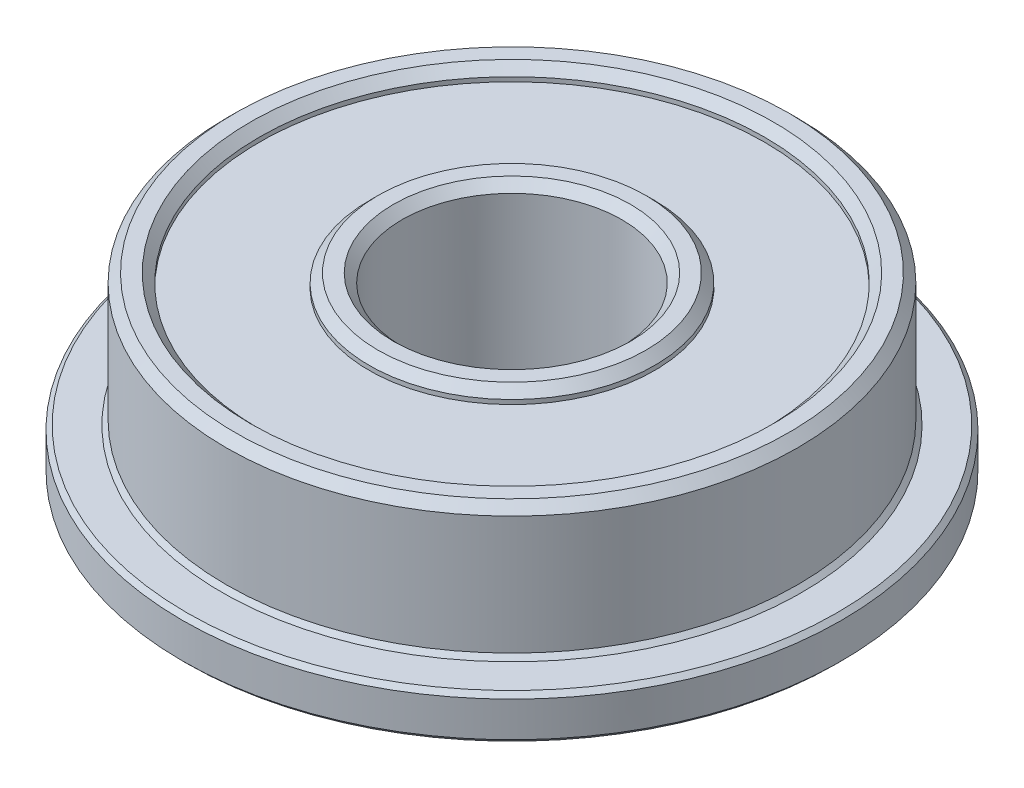
ISO-10303-21;
HEADER;
FILE_DESCRIPTION(('STEP AP214'),'2;1');
FILE_NAME('part.step','',(''),(''),'','','');
FILE_SCHEMA(('AUTOMOTIVE_DESIGN { 1 0 10303 214 1 1 1 1 }'));
ENDSEC;
DATA;
#1=APPLICATION_CONTEXT('core data for automotive mechanical design processes');
#2=APPLICATION_PROTOCOL_DEFINITION('international standard','automotive_design',2000,#1);
#3=PRODUCT_CONTEXT('',#1,'mechanical');
#4=PRODUCT('Part','Part','',(#3));
#5=PRODUCT_RELATED_PRODUCT_CATEGORY('part','',(#4));
#6=PRODUCT_DEFINITION_FORMATION('','',#4);
#7=PRODUCT_DEFINITION_CONTEXT('part definition',#1,'design');
#8=PRODUCT_DEFINITION('design','',#6,#7);
#9=PRODUCT_DEFINITION_SHAPE('','',#8);
#10=(LENGTH_UNIT() NAMED_UNIT(*) SI_UNIT(.MILLI.,.METRE.));
#11=(NAMED_UNIT(*) PLANE_ANGLE_UNIT() SI_UNIT($,.RADIAN.));
#12=(NAMED_UNIT(*) SI_UNIT($,.STERADIAN.) SOLID_ANGLE_UNIT());
#13=UNCERTAINTY_MEASURE_WITH_UNIT(LENGTH_MEASURE(1.E-05),#10,'distance_accuracy_value','');
#14=(GEOMETRIC_REPRESENTATION_CONTEXT(3) GLOBAL_UNCERTAINTY_ASSIGNED_CONTEXT((#13)) GLOBAL_UNIT_ASSIGNED_CONTEXT((#10,
#11,#12)) REPRESENTATION_CONTEXT('',''));
#15=CARTESIAN_POINT('',(0.,0.,0.));
#16=DIRECTION('',(0.,0.,1.));
#17=DIRECTION('',(1.,0.,0.));
#18=AXIS2_PLACEMENT_3D('',#15,#16,#17);
#19=CARTESIAN_POINT('',(0.,0.,0.));
#20=DIRECTION('',(0.,-1.,0.));
#21=DIRECTION('',(0.,0.,-1.));
#22=AXIS2_PLACEMENT_3D('',#19,#20,#21);
#23=PLANE('',#22);
#24=CARTESIAN_POINT('',(0.,0.,0.));
#25=DIRECTION('',(0.,-1.,0.));
#26=DIRECTION('',(0.,0.,-1.));
#27=AXIS2_PLACEMENT_3D('',#24,#25,#26);
#28=CIRCLE('',#27,2.69999999994752);
#29=CARTESIAN_POINT('',(0.,0.,-2.69999999994752));
#30=VERTEX_POINT('',#29);
#31=EDGE_CURVE('E18',#30,#30,#28,.F.);
#32=ORIENTED_EDGE('',*,*,#31,.T.);
#33=EDGE_LOOP('',(#32));
#34=FACE_BOUND('',#33,.T.);
#35=CARTESIAN_POINT('',(0.,-5.68433917557537E-11,0.));
#36=DIRECTION('',(0.,1.,0.));
#37=DIRECTION('',(0.,0.,1.));
#38=AXIS2_PLACEMENT_3D('',#35,#36,#37);
#39=CIRCLE('',#38,3.0500000000302);
#40=CARTESIAN_POINT('',(0.,-5.68440531190789E-11,3.0500000000302));
#41=VERTEX_POINT('',#40);
#42=EDGE_CURVE('E58',#41,#41,#39,.T.);
#43=ORIENTED_EDGE('',*,*,#42,.F.);
#44=EDGE_LOOP('',(#43));
#45=FACE_BOUND('',#44,.T.);
#46=ADVANCED_FACE('F15',(#34,#45),#23,.T.);
#47=CARTESIAN_POINT('',(0.,0.,0.));
#48=DIRECTION('',(0.,-1.,0.));
#49=DIRECTION('',(0.,0.,-1.));
#50=AXIS2_PLACEMENT_3D('',#47,#48,#49);
#51=CONICAL_SURFACE('',#50,2.69999999994752,0.785398163397448);
#52=CARTESIAN_POINT('',(0.,0.2,0.));
#53=DIRECTION('',(0.,-1.,0.));
#54=DIRECTION('',(0.,0.,-1.));
#55=AXIS2_PLACEMENT_3D('',#52,#53,#54);
#56=CIRCLE('',#55,2.5);
#57=CARTESIAN_POINT('',(0.,0.200000000000001,-2.5));
#58=VERTEX_POINT('',#57);
#59=EDGE_CURVE('E55',#58,#58,#56,.F.);
#60=ORIENTED_EDGE('',*,*,#59,.T.);
#61=EDGE_LOOP('',(#60));
#62=FACE_BOUND('',#61,.T.);
#63=ORIENTED_EDGE('',*,*,#31,.F.);
#64=EDGE_LOOP('',(#63));
#65=FACE_BOUND('',#64,.T.);
#66=ADVANCED_FACE('F99',(#62,#65),#51,.F.);
#67=CARTESIAN_POINT('',(0.,0.199999999836109,0.));
#68=DIRECTION('',(0.,1.,0.));
#69=DIRECTION('',(0.,0.,1.));
#70=AXIS2_PLACEMENT_3D('',#67,#68,#69);
#71=CONICAL_SURFACE('',#70,3.24999999992315,0.785398163397448);
#72=CARTESIAN_POINT('',(0.,0.2,0.));
#73=DIRECTION('',(0.,1.,0.));
#74=DIRECTION('',(0.,0.,1.));
#75=AXIS2_PLACEMENT_3D('',#72,#73,#74);
#76=CIRCLE('',#75,3.25);
#77=CARTESIAN_POINT('',(0.,0.199999999999999,3.25));
#78=VERTEX_POINT('',#77);
#79=EDGE_CURVE('E51',#78,#78,#76,.T.);
#80=ORIENTED_EDGE('',*,*,#79,.F.);
#81=EDGE_LOOP('',(#80));
#82=FACE_BOUND('',#81,.T.);
#83=ORIENTED_EDGE('',*,*,#42,.T.);
#84=EDGE_LOOP('',(#83));
#85=FACE_BOUND('',#84,.T.);
#86=ADVANCED_FACE('F101',(#82,#85),#71,.T.);
#87=CARTESIAN_POINT('',(0.,4.,0.));
#88=DIRECTION('',(0.,-1.,0.));
#89=DIRECTION('',(0.,0.,-1.));
#90=AXIS2_PLACEMENT_3D('',#87,#88,#89);
#91=CYLINDRICAL_SURFACE('',#90,2.5);
#92=ORIENTED_EDGE('',*,*,#59,.F.);
#93=EDGE_LOOP('',(#92));
#94=FACE_BOUND('',#93,.T.);
#95=CARTESIAN_POINT('',(0.,3.79999999995562,0.));
#96=DIRECTION('',(0.,1.,0.));
#97=DIRECTION('',(-1.,0.,0.));
#98=AXIS2_PLACEMENT_3D('',#95,#96,#97);
#99=CIRCLE('',#98,2.49999999994088);
#100=CARTESIAN_POINT('',(-2.49999999994088,3.79999999995562,0.));
#101=VERTEX_POINT('',#100);
#102=EDGE_CURVE('E54',#101,#101,#99,.T.);
#103=ORIENTED_EDGE('',*,*,#102,.T.);
#104=EDGE_LOOP('',(#103));
#105=FACE_BOUND('',#104,.T.);
#106=ADVANCED_FACE('F108',(#94,#105),#91,.F.);
#107=CARTESIAN_POINT('',(0.,0.,0.));
#108=DIRECTION('',(0.,1.,0.));
#109=DIRECTION('',(0.,0.,1.));
#110=AXIS2_PLACEMENT_3D('',#107,#108,#109);
#111=CYLINDRICAL_SURFACE('',#110,3.25);
#112=CARTESIAN_POINT('',(0.,0.3,0.));
#113=DIRECTION('',(0.,1.,0.));
#114=DIRECTION('',(0.,0.,1.));
#115=AXIS2_PLACEMENT_3D('',#112,#113,#114);
#116=CIRCLE('',#115,3.25);
#117=CARTESIAN_POINT('',(0.,0.299999999999999,3.25));
#118=VERTEX_POINT('',#117);
#119=EDGE_CURVE('E61',#118,#118,#116,.T.);
#120=ORIENTED_EDGE('',*,*,#119,.F.);
#121=EDGE_LOOP('',(#120));
#122=FACE_BOUND('',#121,.T.);
#123=ORIENTED_EDGE('',*,*,#79,.T.);
#124=EDGE_LOOP('',(#123));
#125=FACE_BOUND('',#124,.T.);
#126=ADVANCED_FACE('F189',(#122,#125),#111,.T.);
#127=CARTESIAN_POINT('',(0.,4.0000000000191,0.));
#128=DIRECTION('',(0.,1.,0.));
#129=DIRECTION('',(0.,0.,1.));
#130=AXIS2_PLACEMENT_3D('',#127,#128,#129);
#131=CONICAL_SURFACE('',#130,2.70000000000437,0.785398163397448);
#132=ORIENTED_EDGE('',*,*,#102,.F.);
#133=EDGE_LOOP('',(#132));
#134=FACE_BOUND('',#133,.T.);
#135=CARTESIAN_POINT('',(0.,4.0000000000191,0.));
#136=DIRECTION('',(0.,1.,0.));
#137=DIRECTION('',(0.,0.,1.));
#138=AXIS2_PLACEMENT_3D('',#135,#136,#137);
#139=CIRCLE('',#138,2.70000000000437);
#140=CARTESIAN_POINT('',(0.,4.0000000000191,2.70000000000437));
#141=VERTEX_POINT('',#140);
#142=EDGE_CURVE('E87',#141,#141,#139,.F.);
#143=ORIENTED_EDGE('',*,*,#142,.F.);
#144=EDGE_LOOP('',(#143));
#145=FACE_BOUND('',#144,.T.);
#146=ADVANCED_FACE('F185',(#134,#145),#131,.F.);
#147=CARTESIAN_POINT('',(0.,0.3,0.));
#148=DIRECTION('',(0.,-1.,0.));
#149=DIRECTION('',(0.,0.,-1.));
#150=AXIS2_PLACEMENT_3D('',#147,#148,#149);
#151=PLANE('',#150);
#152=ORIENTED_EDGE('',*,*,#119,.T.);
#153=EDGE_LOOP('',(#152));
#154=FACE_BOUND('',#153,.T.);
#155=CARTESIAN_POINT('',(0.,0.3,0.));
#156=DIRECTION('',(0.,1.,0.));
#157=DIRECTION('',(0.,0.,1.));
#158=AXIS2_PLACEMENT_3D('',#155,#156,#157);
#159=CIRCLE('',#158,5.75);
#160=CARTESIAN_POINT('',(0.,0.299999999999999,5.75));
#161=VERTEX_POINT('',#160);
#162=EDGE_CURVE('E84',#161,#161,#159,.F.);
#163=ORIENTED_EDGE('',*,*,#162,.T.);
#164=EDGE_LOOP('',(#163));
#165=FACE_BOUND('',#164,.T.);
#166=ADVANCED_FACE('F181',(#154,#165),#151,.T.);
#167=CARTESIAN_POINT('',(0.,4.,0.));
#168=DIRECTION('',(0.,1.,0.));
#169=DIRECTION('',(0.,0.,1.));
#170=AXIS2_PLACEMENT_3D('',#167,#168,#169);
#171=PLANE('',#170);
#172=ORIENTED_EDGE('',*,*,#142,.T.);
#173=EDGE_LOOP('',(#172));
#174=FACE_BOUND('',#173,.T.);
#175=CARTESIAN_POINT('',(0.,3.99999999996226,0.));
#176=DIRECTION('',(0.,-1.,0.));
#177=DIRECTION('',(0.,0.,-1.));
#178=AXIS2_PLACEMENT_3D('',#175,#176,#177);
#179=CIRCLE('',#178,3.0500000000302);
#180=CARTESIAN_POINT('',(0.,3.99999999996226,-3.05000000003019));
#181=VERTEX_POINT('',#180);
#182=EDGE_CURVE('E50',#181,#181,#179,.T.);
#183=ORIENTED_EDGE('',*,*,#182,.F.);
#184=EDGE_LOOP('',(#183));
#185=FACE_BOUND('',#184,.T.);
#186=ADVANCED_FACE('F177',(#174,#185),#171,.T.);
#187=CARTESIAN_POINT('',(0.,0.,0.));
#188=DIRECTION('',(0.,1.,0.));
#189=DIRECTION('',(0.,0.,1.));
#190=AXIS2_PLACEMENT_3D('',#187,#188,#189);
#191=CYLINDRICAL_SURFACE('',#190,5.75);
#192=ORIENTED_EDGE('',*,*,#162,.F.);
#193=EDGE_LOOP('',(#192));
#194=FACE_BOUND('',#193,.T.);
#195=CARTESIAN_POINT('',(0.,0.200000000006639,0.));
#196=DIRECTION('',(0.,-1.,0.));
#197=DIRECTION('',(1.,0.,0.));
#198=AXIS2_PLACEMENT_3D('',#195,#196,#197);
#199=CIRCLE('',#198,5.75000000003456);
#200=CARTESIAN_POINT('',(5.75000000003456,0.200000000006639,0.));
#201=VERTEX_POINT('',#200);
#202=EDGE_CURVE('E47',#201,#201,#199,.T.);
#203=ORIENTED_EDGE('',*,*,#202,.T.);
#204=EDGE_LOOP('',(#203));
#205=FACE_BOUND('',#204,.T.);
#206=ADVANCED_FACE('F173',(#194,#205),#191,.F.);
#207=CARTESIAN_POINT('',(0.,3.80000000001246,0.));
#208=DIRECTION('',(0.,-1.,0.));
#209=DIRECTION('',(0.,0.,-1.));
#210=AXIS2_PLACEMENT_3D('',#207,#208,#209);
#211=CONICAL_SURFACE('',#210,3.24999999997999,0.785398163397448);
#212=CARTESIAN_POINT('',(0.,3.8,0.));
#213=DIRECTION('',(0.,-1.,0.));
#214=DIRECTION('',(0.,0.,-1.));
#215=AXIS2_PLACEMENT_3D('',#212,#213,#214);
#216=CIRCLE('',#215,3.25);
#217=CARTESIAN_POINT('',(0.,3.8,-3.25));
#218=VERTEX_POINT('',#217);
#219=EDGE_CURVE('E43',#218,#218,#216,.T.);
#220=ORIENTED_EDGE('',*,*,#219,.F.);
#221=EDGE_LOOP('',(#220));
#222=FACE_BOUND('',#221,.T.);
#223=ORIENTED_EDGE('',*,*,#182,.T.);
#224=EDGE_LOOP('',(#223));
#225=FACE_BOUND('',#224,.T.);
#226=ADVANCED_FACE('F169',(#222,#225),#211,.T.);
#227=CARTESIAN_POINT('',(0.,5.6843418860808E-11,0.));
#228=DIRECTION('',(0.,-1.,0.));
#229=DIRECTION('',(0.,0.,-1.));
#230=AXIS2_PLACEMENT_3D('',#227,#228,#229);
#231=CONICAL_SURFACE('',#230,5.94999999998436,0.785398163397448);
#232=ORIENTED_EDGE('',*,*,#202,.F.);
#233=EDGE_LOOP('',(#232));
#234=FACE_BOUND('',#233,.T.);
#235=CARTESIAN_POINT('',(0.,0.,0.));
#236=DIRECTION('',(0.,-1.,0.));
#237=DIRECTION('',(0.,0.,-1.));
#238=AXIS2_PLACEMENT_3D('',#235,#236,#237);
#239=CIRCLE('',#238,5.9500000000412);
#240=CARTESIAN_POINT('',(0.,0.,-5.9500000000412));
#241=VERTEX_POINT('',#240);
#242=EDGE_CURVE('E46',#241,#241,#239,.F.);
#243=ORIENTED_EDGE('',*,*,#242,.F.);
#244=EDGE_LOOP('',(#243));
#245=FACE_BOUND('',#244,.T.);
#246=ADVANCED_FACE('F165',(#234,#245),#231,.F.);
#247=CARTESIAN_POINT('',(0.,4.,0.));
#248=DIRECTION('',(0.,-1.,0.));
#249=DIRECTION('',(0.,0.,-1.));
#250=AXIS2_PLACEMENT_3D('',#247,#248,#249);
#251=CYLINDRICAL_SURFACE('',#250,3.25);
#252=CARTESIAN_POINT('',(0.,3.7,0.));
#253=DIRECTION('',(0.,-1.,0.));
#254=DIRECTION('',(0.,0.,-1.));
#255=AXIS2_PLACEMENT_3D('',#252,#253,#254);
#256=CIRCLE('',#255,3.25);
#257=CARTESIAN_POINT('',(0.,3.7,-3.25));
#258=VERTEX_POINT('',#257);
#259=EDGE_CURVE('E77',#258,#258,#256,.T.);
#260=ORIENTED_EDGE('',*,*,#259,.F.);
#261=EDGE_LOOP('',(#260));
#262=FACE_BOUND('',#261,.T.);
#263=ORIENTED_EDGE('',*,*,#219,.T.);
#264=EDGE_LOOP('',(#263));
#265=FACE_BOUND('',#264,.T.);
#266=ADVANCED_FACE('F161',(#262,#265),#251,.T.);
#267=CARTESIAN_POINT('',(0.,0.,0.));
#268=DIRECTION('',(0.,-1.,0.));
#269=DIRECTION('',(0.,0.,-1.));
#270=AXIS2_PLACEMENT_3D('',#267,#268,#269);
#271=PLANE('',#270);
#272=ORIENTED_EDGE('',*,*,#242,.T.);
#273=EDGE_LOOP('',(#272));
#274=FACE_BOUND('',#273,.T.);
#275=CARTESIAN_POINT('',(0.,0.,0.));
#276=DIRECTION('',(0.,1.,0.));
#277=DIRECTION('',(0.,0.,1.));
#278=AXIS2_PLACEMENT_3D('',#275,#276,#277);
#279=CIRCLE('',#278,7.4);
#280=CARTESIAN_POINT('',(0.,0.,7.4));
#281=VERTEX_POINT('',#280);
#282=EDGE_CURVE('E74',#281,#281,#279,.T.);
#283=ORIENTED_EDGE('',*,*,#282,.F.);
#284=EDGE_LOOP('',(#283));
#285=FACE_BOUND('',#284,.T.);
#286=ADVANCED_FACE('F157',(#274,#285),#271,.T.);
#287=CARTESIAN_POINT('',(0.,3.7,0.));
#288=DIRECTION('',(0.,1.,0.));
#289=DIRECTION('',(0.,0.,1.));
#290=AXIS2_PLACEMENT_3D('',#287,#288,#289);
#291=PLANE('',#290);
#292=ORIENTED_EDGE('',*,*,#259,.T.);
#293=EDGE_LOOP('',(#292));
#294=FACE_BOUND('',#293,.T.);
#295=CARTESIAN_POINT('',(0.,3.7,0.));
#296=DIRECTION('',(0.,-1.,0.));
#297=DIRECTION('',(0.,0.,-1.));
#298=AXIS2_PLACEMENT_3D('',#295,#296,#297);
#299=CIRCLE('',#298,5.75);
#300=CARTESIAN_POINT('',(0.,3.7,-5.75));
#301=VERTEX_POINT('',#300);
#302=EDGE_CURVE('E36',#301,#301,#299,.F.);
#303=ORIENTED_EDGE('',*,*,#302,.T.);
#304=EDGE_LOOP('',(#303));
#305=FACE_BOUND('',#304,.T.);
#306=ADVANCED_FACE('F153',(#294,#305),#291,.T.);
#307=CARTESIAN_POINT('',(0.,0.100000000000001,0.));
#308=DIRECTION('',(0.,1.,0.));
#309=DIRECTION('',(0.,0.,1.));
#310=AXIS2_PLACEMENT_3D('',#307,#308,#309);
#311=CONICAL_SURFACE('',#310,7.5,0.785398163397449);
#312=ORIENTED_EDGE('',*,*,#282,.T.);
#313=EDGE_LOOP('',(#312));
#314=FACE_BOUND('',#313,.T.);
#315=CARTESIAN_POINT('',(0.,0.1,0.));
#316=DIRECTION('',(0.,1.,0.));
#317=DIRECTION('',(0.,0.,1.));
#318=AXIS2_PLACEMENT_3D('',#315,#316,#317);
#319=CIRCLE('',#318,7.5);
#320=CARTESIAN_POINT('',(0.,0.1,7.5));
#321=VERTEX_POINT('',#320);
#322=EDGE_CURVE('E32',#321,#321,#319,.T.);
#323=ORIENTED_EDGE('',*,*,#322,.F.);
#324=EDGE_LOOP('',(#323));
#325=FACE_BOUND('',#324,.T.);
#326=ADVANCED_FACE('F149',(#314,#325),#311,.T.);
#327=CARTESIAN_POINT('',(0.,4.,0.));
#328=DIRECTION('',(0.,-1.,0.));
#329=DIRECTION('',(0.,0.,-1.));
#330=AXIS2_PLACEMENT_3D('',#327,#328,#329);
#331=CYLINDRICAL_SURFACE('',#330,5.75);
#332=ORIENTED_EDGE('',*,*,#302,.F.);
#333=EDGE_LOOP('',(#332));
#334=FACE_BOUND('',#333,.T.);
#335=CARTESIAN_POINT('',(0.,3.79999999995562,0.));
#336=DIRECTION('',(0.,1.,0.));
#337=DIRECTION('',(-1.,0.,0.));
#338=AXIS2_PLACEMENT_3D('',#335,#336,#337);
#339=CIRCLE('',#338,5.74999999992087);
#340=CARTESIAN_POINT('',(-5.74999999992087,3.79999999995562,0.));
#341=VERTEX_POINT('',#340);
#342=EDGE_CURVE('E35',#341,#341,#339,.T.);
#343=ORIENTED_EDGE('',*,*,#342,.T.);
#344=EDGE_LOOP('',(#343));
#345=FACE_BOUND('',#344,.T.);
#346=ADVANCED_FACE('F145',(#334,#345),#331,.F.);
#347=CARTESIAN_POINT('',(0.,0.,0.));
#348=DIRECTION('',(0.,1.,0.));
#349=DIRECTION('',(0.,0.,1.));
#350=AXIS2_PLACEMENT_3D('',#347,#348,#349);
#351=CYLINDRICAL_SURFACE('',#350,7.5);
#352=ORIENTED_EDGE('',*,*,#322,.T.);
#353=EDGE_LOOP('',(#352));
#354=FACE_BOUND('',#353,.T.);
#355=CARTESIAN_POINT('',(0.,0.9,0.));
#356=DIRECTION('',(0.,-1.,0.));
#357=DIRECTION('',(1.,0.,0.));
#358=AXIS2_PLACEMENT_3D('',#355,#356,#357);
#359=CIRCLE('',#358,7.5);
#360=CARTESIAN_POINT('',(7.5,0.9,0.));
#361=VERTEX_POINT('',#360);
#362=EDGE_CURVE('E37',#361,#361,#359,.F.);
#363=ORIENTED_EDGE('',*,*,#362,.F.);
#364=EDGE_LOOP('',(#363));
#365=FACE_BOUND('',#364,.T.);
#366=ADVANCED_FACE('F141',(#354,#365),#351,.T.);
#367=CARTESIAN_POINT('',(0.,3.99999999990541,0.));
#368=DIRECTION('',(0.,1.,0.));
#369=DIRECTION('',(0.,0.,1.));
#370=AXIS2_PLACEMENT_3D('',#367,#368,#369);
#371=CONICAL_SURFACE('',#370,5.94999999987067,0.785398163397448);
#372=ORIENTED_EDGE('',*,*,#342,.F.);
#373=EDGE_LOOP('',(#372));
#374=FACE_BOUND('',#373,.T.);
#375=CARTESIAN_POINT('',(0.,3.99999999996226,0.));
#376=DIRECTION('',(0.,1.,0.));
#377=DIRECTION('',(0.,0.,1.));
#378=AXIS2_PLACEMENT_3D('',#375,#376,#377);
#379=CIRCLE('',#378,5.94999999992751);
#380=CARTESIAN_POINT('',(0.,3.99999999996225,5.94999999992751));
#381=VERTEX_POINT('',#380);
#382=EDGE_CURVE('E40',#381,#381,#379,.F.);
#383=ORIENTED_EDGE('',*,*,#382,.F.);
#384=EDGE_LOOP('',(#383));
#385=FACE_BOUND('',#384,.T.);
#386=ADVANCED_FACE('F137',(#374,#385),#371,.F.);
#387=CARTESIAN_POINT('',(0.,0.899999999999999,0.));
#388=DIRECTION('',(0.,-1.,0.));
#389=DIRECTION('',(0.,0.,-1.));
#390=AXIS2_PLACEMENT_3D('',#387,#388,#389);
#391=CONICAL_SURFACE('',#390,7.5,0.785398163397447);
#392=ORIENTED_EDGE('',*,*,#362,.T.);
#393=EDGE_LOOP('',(#392));
#394=FACE_BOUND('',#393,.T.);
#395=CARTESIAN_POINT('',(0.,1.,0.));
#396=DIRECTION('',(0.,-1.,0.));
#397=DIRECTION('',(0.,0.,-1.));
#398=AXIS2_PLACEMENT_3D('',#395,#396,#397);
#399=CIRCLE('',#398,7.4);
#400=CARTESIAN_POINT('',(0.,1.,-7.4));
#401=VERTEX_POINT('',#400);
#402=EDGE_CURVE('E67',#401,#401,#399,.F.);
#403=ORIENTED_EDGE('',*,*,#402,.F.);
#404=EDGE_LOOP('',(#403));
#405=FACE_BOUND('',#404,.T.);
#406=ADVANCED_FACE('F133',(#394,#405),#391,.T.);
#407=CARTESIAN_POINT('',(0.,4.,0.));
#408=DIRECTION('',(0.,1.,0.));
#409=DIRECTION('',(0.,0.,1.));
#410=AXIS2_PLACEMENT_3D('',#407,#408,#409);
#411=PLANE('',#410);
#412=ORIENTED_EDGE('',*,*,#382,.T.);
#413=EDGE_LOOP('',(#412));
#414=FACE_BOUND('',#413,.T.);
#415=CARTESIAN_POINT('',(0.,4.0000000000191,0.));
#416=DIRECTION('',(0.,-1.,0.));
#417=DIRECTION('',(0.,0.,-1.));
#418=AXIS2_PLACEMENT_3D('',#415,#416,#417);
#419=CIRCLE('',#418,6.29999999995334);
#420=CARTESIAN_POINT('',(0.,4.0000000000191,-6.29999999995334));
#421=VERTEX_POINT('',#420);
#422=EDGE_CURVE('E64',#421,#421,#419,.T.);
#423=ORIENTED_EDGE('',*,*,#422,.F.);
#424=EDGE_LOOP('',(#423));
#425=FACE_BOUND('',#424,.T.);
#426=ADVANCED_FACE('F129',(#414,#425),#411,.T.);
#427=CARTESIAN_POINT('',(0.,1.,0.));
#428=DIRECTION('',(0.,1.,0.));
#429=DIRECTION('',(0.,0.,1.));
#430=AXIS2_PLACEMENT_3D('',#427,#428,#429);
#431=PLANE('',#430);
#432=CARTESIAN_POINT('',(0.,1.0000000000332,0.));
#433=DIRECTION('',(0.,-1.,0.));
#434=DIRECTION('',(0.,0.,-1.));
#435=AXIS2_PLACEMENT_3D('',#432,#433,#434);
#436=CIRCLE('',#435,6.59999999999172);
#437=CARTESIAN_POINT('',(0.,1.0000000000332,-6.59999999999172));
#438=VERTEX_POINT('',#437);
#439=EDGE_CURVE('E27',#438,#438,#436,.F.);
#440=ORIENTED_EDGE('',*,*,#439,.F.);
#441=EDGE_LOOP('',(#440));
#442=FACE_BOUND('',#441,.T.);
#443=ORIENTED_EDGE('',*,*,#402,.T.);
#444=EDGE_LOOP('',(#443));
#445=FACE_BOUND('',#444,.T.);
#446=ADVANCED_FACE('F125',(#442,#445),#431,.T.);
#447=CARTESIAN_POINT('',(0.,3.79999999995562,0.));
#448=DIRECTION('',(0.,-1.,0.));
#449=DIRECTION('',(0.,0.,-1.));
#450=AXIS2_PLACEMENT_3D('',#447,#448,#449);
#451=CONICAL_SURFACE('',#450,6.50000000001683,0.785398163397448);
#452=CARTESIAN_POINT('',(0.,3.8,0.));
#453=DIRECTION('',(0.,1.,0.));
#454=DIRECTION('',(0.,0.,1.));
#455=AXIS2_PLACEMENT_3D('',#452,#453,#454);
#456=CIRCLE('',#455,6.5);
#457=CARTESIAN_POINT('',(0.,3.8,6.5));
#458=VERTEX_POINT('',#457);
#459=EDGE_CURVE('E22',#458,#458,#456,.F.);
#460=ORIENTED_EDGE('',*,*,#459,.F.);
#461=EDGE_LOOP('',(#460));
#462=FACE_BOUND('',#461,.T.);
#463=ORIENTED_EDGE('',*,*,#422,.T.);
#464=EDGE_LOOP('',(#463));
#465=FACE_BOUND('',#464,.T.);
#466=ADVANCED_FACE('F118',(#462,#465),#451,.T.);
#467=CARTESIAN_POINT('',(0.,1.0000000000332,0.));
#468=DIRECTION('',(0.,-1.,0.));
#469=DIRECTION('',(0.,0.,-1.));
#470=AXIS2_PLACEMENT_3D('',#467,#468,#469);
#471=CONICAL_SURFACE('',#470,6.59999999999172,0.785398163397448);
#472=ORIENTED_EDGE('',*,*,#439,.T.);
#473=EDGE_LOOP('',(#472));
#474=FACE_BOUND('',#473,.T.);
#475=CARTESIAN_POINT('',(0.,1.1,0.));
#476=DIRECTION('',(0.,1.,0.));
#477=DIRECTION('',(0.,0.,1.));
#478=AXIS2_PLACEMENT_3D('',#475,#476,#477);
#479=CIRCLE('',#478,6.5);
#480=CARTESIAN_POINT('',(0.,1.1,6.5));
#481=VERTEX_POINT('',#480);
#482=EDGE_CURVE('E10',#481,#481,#479,.T.);
#483=ORIENTED_EDGE('',*,*,#482,.F.);
#484=EDGE_LOOP('',(#483));
#485=FACE_BOUND('',#484,.T.);
#486=ADVANCED_FACE('F113',(#474,#485),#471,.T.);
#487=CARTESIAN_POINT('',(0.,2.,0.));
#488=DIRECTION('',(0.,1.,0.));
#489=DIRECTION('',(0.,0.,1.));
#490=AXIS2_PLACEMENT_3D('',#487,#488,#489);
#491=CYLINDRICAL_SURFACE('',#490,6.5);
#492=ORIENTED_EDGE('',*,*,#482,.T.);
#493=EDGE_LOOP('',(#492));
#494=FACE_BOUND('',#493,.T.);
#495=ORIENTED_EDGE('',*,*,#459,.T.);
#496=EDGE_LOOP('',(#495));
#497=FACE_BOUND('',#496,.T.);
#498=ADVANCED_FACE('F111',(#494,#497),#491,.T.);
#499=CLOSED_SHELL('',(#46,#66,#86,#106,#126,#146,#166,#186,#206,#226,#246,#266,#286,#306,#326,
#346,#366,#386,#406,#426,#446,#466,#486,#498));
#500=MANIFOLD_SOLID_BREP('B1',#499);
#501=ADVANCED_BREP_SHAPE_REPRESENTATION('',(#18,#500),#14);
#502=SHAPE_DEFINITION_REPRESENTATION(#9,#501);
ENDSEC;
END-ISO-10303-21;
